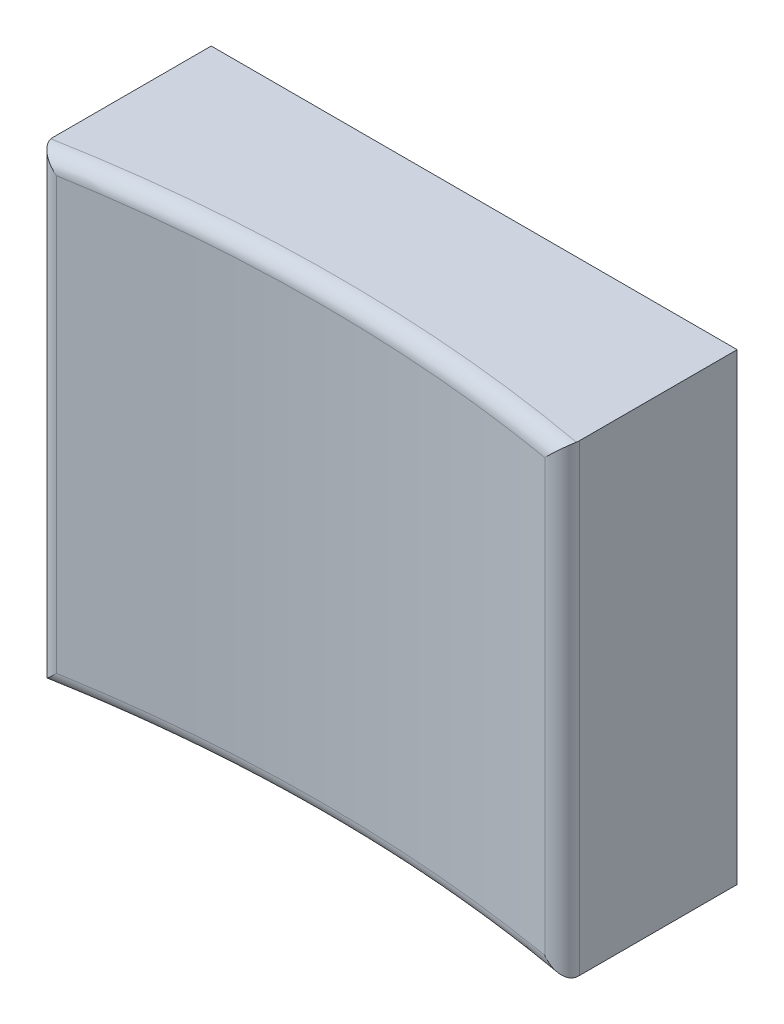
ISO-10303-21;
HEADER;
FILE_DESCRIPTION(('STEP AP214'),'2;1');
FILE_NAME('part.step','',(''),(''),'','','');
FILE_SCHEMA(('AUTOMOTIVE_DESIGN { 1 0 10303 214 1 1 1 1 }'));
ENDSEC;
DATA;
#1=APPLICATION_CONTEXT('core data for automotive mechanical design processes');
#2=APPLICATION_PROTOCOL_DEFINITION('international standard','automotive_design',2000,#1);
#3=PRODUCT_CONTEXT('',#1,'mechanical');
#4=PRODUCT('Part','Part','',(#3));
#5=PRODUCT_RELATED_PRODUCT_CATEGORY('part','',(#4));
#6=PRODUCT_DEFINITION_FORMATION('','',#4);
#7=PRODUCT_DEFINITION_CONTEXT('part definition',#1,'design');
#8=PRODUCT_DEFINITION('design','',#6,#7);
#9=PRODUCT_DEFINITION_SHAPE('','',#8);
#10=(LENGTH_UNIT() NAMED_UNIT(*) SI_UNIT(.MILLI.,.METRE.));
#11=(NAMED_UNIT(*) PLANE_ANGLE_UNIT() SI_UNIT($,.RADIAN.));
#12=(NAMED_UNIT(*) SI_UNIT($,.STERADIAN.) SOLID_ANGLE_UNIT());
#13=UNCERTAINTY_MEASURE_WITH_UNIT(LENGTH_MEASURE(1.E-05),#10,'distance_accuracy_value','');
#14=(GEOMETRIC_REPRESENTATION_CONTEXT(3) GLOBAL_UNCERTAINTY_ASSIGNED_CONTEXT((#13)) GLOBAL_UNIT_ASSIGNED_CONTEXT((#10,
#11,#12)) REPRESENTATION_CONTEXT('',''));
#15=CARTESIAN_POINT('',(0.,0.,0.));
#16=DIRECTION('',(0.,0.,1.));
#17=DIRECTION('',(1.,0.,0.));
#18=AXIS2_PLACEMENT_3D('',#15,#16,#17);
#19=CARTESIAN_POINT('',(-4.1529,3.6576,2.794));
#20=DIRECTION('',(1.,0.,0.));
#21=DIRECTION('',(0.,0.,-1.));
#22=AXIS2_PLACEMENT_3D('',#19,#20,#21);
#23=PLANE('',#22);
#24=DIRECTION('',(0.,0.,-1.));
#25=VECTOR('',#24,1.);
#26=CARTESIAN_POINT('',(-4.1529,-3.6576,2.794));
#27=LINE('',#26,#25);
#28=CARTESIAN_POINT('',(-4.1529,-3.6576,2.49082226780297));
#29=VERTEX_POINT('',#28);
#30=CARTESIAN_POINT('',(-4.1529,-3.6576,0.));
#31=VERTEX_POINT('',#30);
#32=EDGE_CURVE('E102',#29,#31,#27,.T.);
#33=ORIENTED_EDGE('',*,*,#32,.F.);
#34=DIRECTION('',(0.,-1.,0.));
#35=VECTOR('',#34,1.);
#36=CARTESIAN_POINT('',(-4.1529,3.6576,2.49082226780297));
#37=LINE('',#36,#35);
#38=CARTESIAN_POINT('',(-4.1529,3.6576,2.49082226780297));
#39=VERTEX_POINT('',#38);
#40=EDGE_CURVE('E11',#29,#39,#37,.F.);
#41=ORIENTED_EDGE('',*,*,#40,.T.);
#42=DIRECTION('',(0.,0.,-1.));
#43=VECTOR('',#42,1.);
#44=CARTESIAN_POINT('',(-4.1529,3.6576,2.794));
#45=LINE('',#44,#43);
#46=CARTESIAN_POINT('',(-4.1529,3.6576,0.));
#47=VERTEX_POINT('',#46);
#48=EDGE_CURVE('E125',#39,#47,#45,.T.);
#49=ORIENTED_EDGE('',*,*,#48,.T.);
#50=DIRECTION('',(0.,-1.,0.));
#51=VECTOR('',#50,1.);
#52=CARTESIAN_POINT('',(-4.1529,3.6576,0.));
#53=LINE('',#52,#51);
#54=EDGE_CURVE('E121',#47,#31,#53,.T.);
#55=ORIENTED_EDGE('',*,*,#54,.T.);
#56=EDGE_LOOP('',(#33,#41,#49,#55));
#57=FACE_BOUND('',#56,.T.);
#58=ADVANCED_FACE('F32',(#57),#23,.F.);
#59=CARTESIAN_POINT('',(-4.1529,-3.6576,2.794));
#60=DIRECTION('',(0.,1.,0.));
#61=DIRECTION('',(0.,0.,1.));
#62=AXIS2_PLACEMENT_3D('',#59,#60,#61);
#63=PLANE('',#62);
#64=DIRECTION('',(0.,0.,-1.));
#65=VECTOR('',#64,1.);
#66=CARTESIAN_POINT('',(4.1529,-3.6576,2.794));
#67=LINE('',#66,#65);
#68=CARTESIAN_POINT('',(4.1529,-3.6576,2.49082226780297));
#69=VERTEX_POINT('',#68);
#70=CARTESIAN_POINT('',(4.1529,-3.6576,0.));
#71=VERTEX_POINT('',#70);
#72=EDGE_CURVE('E115',#69,#71,#67,.T.);
#73=ORIENTED_EDGE('',*,*,#72,.F.);
#74=CARTESIAN_POINT('',(3.8989,-3.6576,2.49082226780297));
#75=DIRECTION('',(0.,1.,0.));
#76=DIRECTION('',(0.,0.,1.));
#77=AXIS2_PLACEMENT_3D('',#74,#75,#76);
#78=CIRCLE('',#77,0.254);
#79=CARTESIAN_POINT('',(4.14902115128335,-3.6576,2.53504228228519));
#80=VERTEX_POINT('',#79);
#81=EDGE_CURVE('E149',#69,#80,#78,.F.);
#82=ORIENTED_EDGE('',*,*,#81,.T.);
#83=CARTESIAN_POINT('',(0.,-3.6576,25.2736134662053));
#84=DIRECTION('',(0.,1.,0.));
#85=DIRECTION('',(0.,0.,1.));
#86=AXIS2_PLACEMENT_3D('',#83,#84,#85);
#87=CIRCLE('',#86,23.114);
#88=CARTESIAN_POINT('',(-4.14902115128334,-3.6576,2.53504228228519));
#89=VERTEX_POINT('',#88);
#90=EDGE_CURVE('E147',#80,#89,#87,.T.);
#91=ORIENTED_EDGE('',*,*,#90,.T.);
#92=CARTESIAN_POINT('',(-3.8989,-3.6576,2.49082226780297));
#93=DIRECTION('',(0.,1.,0.));
#94=DIRECTION('',(0.,0.,1.));
#95=AXIS2_PLACEMENT_3D('',#92,#93,#94);
#96=CIRCLE('',#95,0.254);
#97=EDGE_CURVE('E110',#89,#29,#96,.F.);
#98=ORIENTED_EDGE('',*,*,#97,.T.);
#99=ORIENTED_EDGE('',*,*,#32,.T.);
#100=DIRECTION('',(1.,0.,0.));
#101=VECTOR('',#100,1.);
#102=CARTESIAN_POINT('',(-4.1529,-3.6576,0.));
#103=LINE('',#102,#101);
#104=EDGE_CURVE('E106',#31,#71,#103,.T.);
#105=ORIENTED_EDGE('',*,*,#104,.T.);
#106=EDGE_LOOP('',(#73,#82,#91,#98,#99,#105));
#107=FACE_BOUND('',#106,.T.);
#108=ADVANCED_FACE('F105',(#107),#63,.F.);
#109=CARTESIAN_POINT('',(4.1529,3.6576,2.794));
#110=DIRECTION('',(-1.,0.,0.));
#111=DIRECTION('',(0.,0.,1.));
#112=AXIS2_PLACEMENT_3D('',#109,#110,#111);
#113=PLANE('',#112);
#114=DIRECTION('',(0.,0.,-1.));
#115=VECTOR('',#114,1.);
#116=CARTESIAN_POINT('',(4.1529,3.6576,2.794));
#117=LINE('',#116,#115);
#118=CARTESIAN_POINT('',(4.1529,3.6576,2.49082226780297));
#119=VERTEX_POINT('',#118);
#120=CARTESIAN_POINT('',(4.1529,3.6576,0.));
#121=VERTEX_POINT('',#120);
#122=EDGE_CURVE('E135',#119,#121,#117,.T.);
#123=ORIENTED_EDGE('',*,*,#122,.F.);
#124=DIRECTION('',(0.,-1.,0.));
#125=VECTOR('',#124,1.);
#126=CARTESIAN_POINT('',(4.1529,3.6576,2.49082226780297));
#127=LINE('',#126,#125);
#128=EDGE_CURVE('E46',#119,#69,#127,.T.);
#129=ORIENTED_EDGE('',*,*,#128,.T.);
#130=ORIENTED_EDGE('',*,*,#72,.T.);
#131=DIRECTION('',(0.,1.,0.));
#132=VECTOR('',#131,1.);
#133=CARTESIAN_POINT('',(4.1529,3.6576,0.));
#134=LINE('',#133,#132);
#135=EDGE_CURVE('E123',#71,#121,#134,.T.);
#136=ORIENTED_EDGE('',*,*,#135,.T.);
#137=EDGE_LOOP('',(#123,#129,#130,#136));
#138=FACE_BOUND('',#137,.T.);
#139=ADVANCED_FACE('F203',(#138),#113,.F.);
#140=CARTESIAN_POINT('',(-4.1529,3.6576,2.794));
#141=DIRECTION('',(0.,-1.,0.));
#142=DIRECTION('',(0.,0.,-1.));
#143=AXIS2_PLACEMENT_3D('',#140,#141,#142);
#144=PLANE('',#143);
#145=CARTESIAN_POINT('',(0.,3.6576,25.2736134662053));
#146=DIRECTION('',(0.,-1.,0.));
#147=DIRECTION('',(0.,0.,-1.));
#148=AXIS2_PLACEMENT_3D('',#145,#146,#147);
#149=CIRCLE('',#148,23.114);
#150=CARTESIAN_POINT('',(-4.14902115128334,3.6576,2.53504228228519));
#151=VERTEX_POINT('',#150);
#152=CARTESIAN_POINT('',(4.14902115128335,3.6576,2.53504228228519));
#153=VERTEX_POINT('',#152);
#154=EDGE_CURVE('E54',#151,#153,#149,.T.);
#155=ORIENTED_EDGE('',*,*,#154,.T.);
#156=CARTESIAN_POINT('',(3.8989,3.6576,2.49082226780297));
#157=DIRECTION('',(0.,-1.,0.));
#158=DIRECTION('',(0.,0.,-1.));
#159=AXIS2_PLACEMENT_3D('',#156,#157,#158);
#160=CIRCLE('',#159,0.254);
#161=EDGE_CURVE('E153',#153,#119,#160,.F.);
#162=ORIENTED_EDGE('',*,*,#161,.T.);
#163=ORIENTED_EDGE('',*,*,#122,.T.);
#164=DIRECTION('',(-1.,0.,0.));
#165=VECTOR('',#164,1.);
#166=CARTESIAN_POINT('',(-4.1529,3.6576,0.));
#167=LINE('',#166,#165);
#168=EDGE_CURVE('E132',#121,#47,#167,.T.);
#169=ORIENTED_EDGE('',*,*,#168,.T.);
#170=ORIENTED_EDGE('',*,*,#48,.F.);
#171=CARTESIAN_POINT('',(-3.8989,3.6576,2.49082226780297));
#172=DIRECTION('',(0.,-1.,0.));
#173=DIRECTION('',(0.,0.,-1.));
#174=AXIS2_PLACEMENT_3D('',#171,#172,#173);
#175=CIRCLE('',#174,0.254);
#176=EDGE_CURVE('E59',#39,#151,#175,.F.);
#177=ORIENTED_EDGE('',*,*,#176,.T.);
#178=EDGE_LOOP('',(#155,#162,#163,#169,#170,#177));
#179=FACE_BOUND('',#178,.T.);
#180=ADVANCED_FACE('F201',(#179),#144,.F.);
#181=CARTESIAN_POINT('',(-4.1529,-3.6576,0.));
#182=DIRECTION('',(0.,0.,1.));
#183=DIRECTION('',(1.,0.,0.));
#184=AXIS2_PLACEMENT_3D('',#181,#182,#183);
#185=PLANE('',#184);
#186=ORIENTED_EDGE('',*,*,#54,.F.);
#187=ORIENTED_EDGE('',*,*,#168,.F.);
#188=ORIENTED_EDGE('',*,*,#135,.F.);
#189=ORIENTED_EDGE('',*,*,#104,.F.);
#190=EDGE_LOOP('',(#186,#187,#188,#189));
#191=FACE_BOUND('',#190,.T.);
#192=ADVANCED_FACE('F119',(#191),#185,.F.);
#193=CARTESIAN_POINT('',(0.,3.6576,25.2736134662053));
#194=DIRECTION('',(0.,-1.,0.));
#195=DIRECTION('',(0.,0.,-1.));
#196=AXIS2_PLACEMENT_3D('',#193,#194,#195);
#197=CYLINDRICAL_SURFACE('',#196,22.86);
#198=DIRECTION('',(0.,-1.,0.));
#199=VECTOR('',#198,1.);
#200=CARTESIAN_POINT('',(-3.85605494505495,3.6576,2.74118261064256));
#201=LINE('',#200,#199);
#202=CARTESIAN_POINT('',(-3.85605494505494,3.4036,2.74118261064256));
#203=VERTEX_POINT('',#202);
#204=CARTESIAN_POINT('',(-3.85605494505494,-3.4036,2.74118261064256));
#205=VERTEX_POINT('',#204);
#206=EDGE_CURVE('E114',#203,#205,#201,.T.);
#207=ORIENTED_EDGE('',*,*,#206,.T.);
#208=CARTESIAN_POINT('',(0.,-3.4036,25.2736134662053));
#209=DIRECTION('',(0.,1.,0.));
#210=DIRECTION('',(0.,0.,1.));
#211=AXIS2_PLACEMENT_3D('',#208,#209,#210);
#212=CIRCLE('',#211,22.86);
#213=CARTESIAN_POINT('',(3.85605494505495,-3.4036,2.74118261064256));
#214=VERTEX_POINT('',#213);
#215=EDGE_CURVE('E143',#205,#214,#212,.F.);
#216=ORIENTED_EDGE('',*,*,#215,.T.);
#217=DIRECTION('',(0.,-1.,0.));
#218=VECTOR('',#217,1.);
#219=CARTESIAN_POINT('',(3.85605494505495,3.6576,2.74118261064256));
#220=LINE('',#219,#218);
#221=CARTESIAN_POINT('',(3.85605494505494,3.4036,2.74118261064256));
#222=VERTEX_POINT('',#221);
#223=EDGE_CURVE('E141',#214,#222,#220,.F.);
#224=ORIENTED_EDGE('',*,*,#223,.T.);
#225=CARTESIAN_POINT('',(0.,3.4036,25.2736134662053));
#226=DIRECTION('',(0.,-1.,0.));
#227=DIRECTION('',(0.,0.,-1.));
#228=AXIS2_PLACEMENT_3D('',#225,#226,#227);
#229=CIRCLE('',#228,22.86);
#230=EDGE_CURVE('E139',#222,#203,#229,.F.);
#231=ORIENTED_EDGE('',*,*,#230,.T.);
#232=EDGE_LOOP('',(#207,#216,#224,#231));
#233=FACE_BOUND('',#232,.T.);
#234=ADVANCED_FACE('F197',(#233),#197,.F.);
#235=CARTESIAN_POINT('',(0.,3.4036,25.2736134662053));
#236=DIRECTION('',(0.,-1.,0.));
#237=DIRECTION('',(0.,0.,-1.));
#238=AXIS2_PLACEMENT_3D('',#235,#236,#237);
#239=TOROIDAL_SURFACE('',#238,23.114,0.254);
#240=CARTESIAN_POINT('',(4.14902115128334,3.6576,2.53504228228519));
#241=CARTESIAN_POINT('',(4.147057413291,3.65761941798704,2.54626051410528));
#242=CARTESIAN_POINT('',(4.14430772511394,3.6568354333532,2.55731081895926));
#243=CARTESIAN_POINT('',(4.13747618648574,3.65382566993983,2.57868277036022));
#244=CARTESIAN_POINT('',(4.13340609550221,3.65161245353686,2.58900990487564));
#245=CARTESIAN_POINT('',(4.12414457602549,3.64591191486797,2.60872099226871));
#246=CARTESIAN_POINT('',(4.11895619634246,3.64242803929229,2.61810740987538));
#247=CARTESIAN_POINT('',(4.10768989632173,3.63439821947881,2.63585133698443));
#248=CARTESIAN_POINT('',(4.10160999846191,3.6298499004188,2.64420648105353));
#249=CARTESIAN_POINT('',(4.08616781818806,3.61787034509634,2.66301192454394));
#250=CARTESIAN_POINT('',(4.07647841036786,3.61002001166474,2.67292620715351));
#251=CARTESIAN_POINT('',(4.05626652321987,3.59311999450385,2.69065535724881));
#252=CARTESIAN_POINT('',(4.04574245787371,3.58406800428347,2.69846609755017));
#253=CARTESIAN_POINT('',(4.01998736240649,3.56142212858062,2.71480621902723));
#254=CARTESIAN_POINT('',(4.00452436143891,3.5474358957305,2.72242320526477));
#255=CARTESIAN_POINT('',(3.9732291866513,3.51849989343228,2.73427998095239));
#256=CARTESIAN_POINT('',(3.95739661035331,3.50354903893871,2.73851589304369));
#257=CARTESIAN_POINT('',(3.92754170272988,3.4748495058296,2.74360271280981));
#258=CARTESIAN_POINT('',(3.91351825281961,3.46115745374889,2.74478377230257));
#259=CARTESIAN_POINT('',(3.88568860791458,3.43359421272603,2.7448588164792));
#260=CARTESIAN_POINT('',(3.87188203426182,3.41972343717708,2.74375737401577));
#261=CARTESIAN_POINT('',(3.85753243966568,3.40510670739394,2.74143209205596));
#262=CARTESIAN_POINT('',(3.8567933938316,3.40435333384913,2.74130897875889));
#263=CARTESIAN_POINT('',(3.85605494505495,3.4036,2.74118261064256));
#264=B_SPLINE_CURVE_WITH_KNOTS('',3,(#240,#241,#242,#243,#244,#245,#246,#247,#248,#249,#250,
#251,#252,#253,#254,#255,#256,#257,#258,#259,#260,#261,#262,#263),.UNSPECIFIED.,.F.,.F.,(4,2,2,
2,2,2,2,2,2,2,2,4),(0.,0.0340672177638823,0.0678390004190167,0.101519849519903,
0.135276570813308,0.182806102249537,0.230428219033018,0.296664129326276,0.362975889149356,
0.421746978486034,0.480400437389645,0.483587928393868),.UNSPECIFIED.);
#265=EDGE_CURVE('E129',#153,#222,#264,.T.);
#266=ORIENTED_EDGE('',*,*,#265,.F.);
#267=ORIENTED_EDGE('',*,*,#154,.F.);
#268=CARTESIAN_POINT('',(-4.14902115128334,3.6576,2.53504228228519));
#269=CARTESIAN_POINT('',(-4.147057413291,3.65761941798704,2.54626051410528));
#270=CARTESIAN_POINT('',(-4.14430772511394,3.6568354333532,2.55731081895926));
#271=CARTESIAN_POINT('',(-4.13747618648574,3.65382566993983,2.57868277036022));
#272=CARTESIAN_POINT('',(-4.13340609550221,3.65161245353686,2.58900990487564));
#273=CARTESIAN_POINT('',(-4.12414457602549,3.64591191486797,2.60872099226871));
#274=CARTESIAN_POINT('',(-4.11895619634246,3.64242803929229,2.61810740987538));
#275=CARTESIAN_POINT('',(-4.10768989632173,3.63439821947881,2.63585133698443));
#276=CARTESIAN_POINT('',(-4.10160999846191,3.6298499004188,2.64420648105353));
#277=CARTESIAN_POINT('',(-4.08616781818806,3.61787034509634,2.66301192454394));
#278=CARTESIAN_POINT('',(-4.07647841036786,3.61002001166474,2.67292620715351));
#279=CARTESIAN_POINT('',(-4.05626652321987,3.59311999450385,2.69065535724881));
#280=CARTESIAN_POINT('',(-4.04574245787371,3.58406800428347,2.69846609755017));
#281=CARTESIAN_POINT('',(-4.01998736240649,3.56142212858062,2.71480621902723));
#282=CARTESIAN_POINT('',(-4.00452436143891,3.5474358957305,2.72242320526477));
#283=CARTESIAN_POINT('',(-3.9732291866513,3.51849989343228,2.73427998095239));
#284=CARTESIAN_POINT('',(-3.95739661035331,3.50354903893871,2.73851589304369));
#285=CARTESIAN_POINT('',(-3.92754170272988,3.4748495058296,2.74360271280981));
#286=CARTESIAN_POINT('',(-3.91351825281961,3.46115745374889,2.74478377230257));
#287=CARTESIAN_POINT('',(-3.88568860791458,3.43359421272603,2.7448588164792));
#288=CARTESIAN_POINT('',(-3.87188203426182,3.41972343717708,2.74375737401577));
#289=CARTESIAN_POINT('',(-3.85753243966568,3.40510670739394,2.74143209205596));
#290=CARTESIAN_POINT('',(-3.8567933938316,3.40435333384913,2.74130897875889));
#291=CARTESIAN_POINT('',(-3.85605494505495,3.4036,2.74118261064256));
#292=B_SPLINE_CURVE_WITH_KNOTS('',3,(#268,#269,#270,#271,#272,#273,#274,#275,#276,#277,#278,
#279,#280,#281,#282,#283,#284,#285,#286,#287,#288,#289,#290,#291),.UNSPECIFIED.,.F.,.F.,(4,2,2,
2,2,2,2,2,2,2,2,4),(0.,0.0340672177638823,0.0678390004190167,0.101519849519903,
0.135276570813308,0.182806102249537,0.230428219033018,0.296664129326276,0.362975889149356,
0.421746978486034,0.480400437389645,0.483587928393868),.UNSPECIFIED.);
#293=EDGE_CURVE('E37',#203,#151,#292,.F.);
#294=ORIENTED_EDGE('',*,*,#293,.F.);
#295=ORIENTED_EDGE('',*,*,#230,.F.);
#296=EDGE_LOOP('',(#266,#267,#294,#295));
#297=FACE_BOUND('',#296,.T.);
#298=ADVANCED_FACE('F34',(#297),#239,.T.);
#299=CARTESIAN_POINT('',(-3.8989,3.6576,2.49082226780297));
#300=DIRECTION('',(0.,-1.,0.));
#301=DIRECTION('',(0.,0.,-1.));
#302=AXIS2_PLACEMENT_3D('',#299,#300,#301);
#303=CYLINDRICAL_SURFACE('',#302,0.254);
#304=ORIENTED_EDGE('',*,*,#40,.F.);
#305=ORIENTED_EDGE('',*,*,#97,.F.);
#306=CARTESIAN_POINT('',(-4.14902115128334,-3.6576,2.53504228228519));
#307=CARTESIAN_POINT('',(-4.147057413291,-3.65761941798704,2.54626051410528));
#308=CARTESIAN_POINT('',(-4.14430772511394,-3.6568354333532,2.55731081895926));
#309=CARTESIAN_POINT('',(-4.13747618648574,-3.65382566993983,2.57868277036022));
#310=CARTESIAN_POINT('',(-4.13340609550221,-3.65161245353686,2.58900990487564));
#311=CARTESIAN_POINT('',(-4.12414457602549,-3.64591191486797,2.60872099226871));
#312=CARTESIAN_POINT('',(-4.11895619634246,-3.64242803929229,2.61810740987538));
#313=CARTESIAN_POINT('',(-4.10768989632173,-3.63439821947881,2.63585133698443));
#314=CARTESIAN_POINT('',(-4.10160999846191,-3.6298499004188,2.64420648105353));
#315=CARTESIAN_POINT('',(-4.08616781818806,-3.61787034509634,2.66301192454394));
#316=CARTESIAN_POINT('',(-4.07647841036786,-3.61002001166474,2.67292620715351));
#317=CARTESIAN_POINT('',(-4.05626652321987,-3.59311999450385,2.69065535724881));
#318=CARTESIAN_POINT('',(-4.04574245787371,-3.58406800428347,2.69846609755017));
#319=CARTESIAN_POINT('',(-4.01998736240649,-3.56142212858062,2.71480621902723));
#320=CARTESIAN_POINT('',(-4.00452436143891,-3.5474358957305,2.72242320526477));
#321=CARTESIAN_POINT('',(-3.9732291866513,-3.51849989343228,2.73427998095239));
#322=CARTESIAN_POINT('',(-3.95739661035331,-3.50354903893871,2.73851589304369));
#323=CARTESIAN_POINT('',(-3.92754170272988,-3.4748495058296,2.74360271280981));
#324=CARTESIAN_POINT('',(-3.91351825281961,-3.46115745374889,2.74478377230257));
#325=CARTESIAN_POINT('',(-3.88568860791458,-3.43359421272603,2.7448588164792));
#326=CARTESIAN_POINT('',(-3.87188203426182,-3.41972343717708,2.74375737401577));
#327=CARTESIAN_POINT('',(-3.85753243966568,-3.40510670739394,2.74143209205596));
#328=CARTESIAN_POINT('',(-3.8567933938316,-3.40435333384913,2.74130897875889));
#329=CARTESIAN_POINT('',(-3.85605494505495,-3.4036,2.74118261064256));
#330=B_SPLINE_CURVE_WITH_KNOTS('',3,(#306,#307,#308,#309,#310,#311,#312,#313,#314,#315,#316,
#317,#318,#319,#320,#321,#322,#323,#324,#325,#326,#327,#328,#329),.UNSPECIFIED.,.F.,.F.,(4,2,2,
2,2,2,2,2,2,2,2,4),(0.,0.0340672177638823,0.0678390004190167,0.101519849519903,
0.135276570813308,0.182806102249537,0.230428219033018,0.296664129326276,0.362975889149356,
0.421746978486034,0.480400437389645,0.483587928393868),.UNSPECIFIED.);
#331=EDGE_CURVE('E164',#205,#89,#330,.F.);
#332=ORIENTED_EDGE('',*,*,#331,.F.);
#333=ORIENTED_EDGE('',*,*,#206,.F.);
#334=ORIENTED_EDGE('',*,*,#293,.T.);
#335=ORIENTED_EDGE('',*,*,#176,.F.);
#336=EDGE_LOOP('',(#304,#305,#332,#333,#334,#335));
#337=FACE_BOUND('',#336,.T.);
#338=ADVANCED_FACE('F175',(#337),#303,.T.);
#339=CARTESIAN_POINT('',(3.8989,3.6576,2.49082226780297));
#340=DIRECTION('',(0.,-1.,0.));
#341=DIRECTION('',(0.,0.,-1.));
#342=AXIS2_PLACEMENT_3D('',#339,#340,#341);
#343=CYLINDRICAL_SURFACE('',#342,0.254);
#344=ORIENTED_EDGE('',*,*,#265,.T.);
#345=ORIENTED_EDGE('',*,*,#223,.F.);
#346=CARTESIAN_POINT('',(4.14902115128334,-3.6576,2.53504228228519));
#347=CARTESIAN_POINT('',(4.147057413291,-3.65761941798704,2.54626051410528));
#348=CARTESIAN_POINT('',(4.14430772511394,-3.6568354333532,2.55731081895926));
#349=CARTESIAN_POINT('',(4.13747618648574,-3.65382566993983,2.57868277036022));
#350=CARTESIAN_POINT('',(4.13340609550221,-3.65161245353686,2.58900990487564));
#351=CARTESIAN_POINT('',(4.12414457602549,-3.64591191486797,2.60872099226871));
#352=CARTESIAN_POINT('',(4.11895619634246,-3.64242803929229,2.61810740987538));
#353=CARTESIAN_POINT('',(4.10768989632173,-3.63439821947881,2.63585133698443));
#354=CARTESIAN_POINT('',(4.10160999846191,-3.6298499004188,2.64420648105353));
#355=CARTESIAN_POINT('',(4.08616781818806,-3.61787034509634,2.66301192454394));
#356=CARTESIAN_POINT('',(4.07647841036786,-3.61002001166474,2.67292620715351));
#357=CARTESIAN_POINT('',(4.05626652321987,-3.59311999450385,2.69065535724881));
#358=CARTESIAN_POINT('',(4.04574245787371,-3.58406800428347,2.69846609755017));
#359=CARTESIAN_POINT('',(4.01998736240649,-3.56142212858062,2.71480621902723));
#360=CARTESIAN_POINT('',(4.00452436143892,-3.54743589573049,2.72242320526477));
#361=CARTESIAN_POINT('',(3.9732291866513,-3.51849989343228,2.73427998095239));
#362=CARTESIAN_POINT('',(3.9573966103533,-3.50354903893872,2.73851589304369));
#363=CARTESIAN_POINT('',(3.92754170272989,-3.47484950582959,2.74360271280981));
#364=CARTESIAN_POINT('',(3.91351825281964,-3.46115745374887,2.74478377230257));
#365=CARTESIAN_POINT('',(3.88568860791457,-3.43359421272604,2.7448588164792));
#366=CARTESIAN_POINT('',(3.87188203426175,-3.41972343717715,2.74375737401576));
#367=CARTESIAN_POINT('',(3.85753243966567,-3.40510670739395,2.74143209205596));
#368=CARTESIAN_POINT('',(3.85679339383159,-3.40435333384913,2.74130897875889));
#369=CARTESIAN_POINT('',(3.85605494505495,-3.4036,2.74118261064256));
#370=B_SPLINE_CURVE_WITH_KNOTS('',3,(#346,#347,#348,#349,#350,#351,#352,#353,#354,#355,#356,
#357,#358,#359,#360,#361,#362,#363,#364,#365,#366,#367,#368,#369),.UNSPECIFIED.,.F.,.F.,(4,2,2,
2,2,2,2,2,2,2,2,4),(0.,0.0340672177638827,0.0678390004190167,0.101519849519903,
0.135276570813308,0.182806102249536,0.230428219033018,0.296664129326277,0.362975889149356,
0.421746978486034,0.480400437389645,0.483587928393868),.UNSPECIFIED.);
#371=EDGE_CURVE('E156',#80,#214,#370,.T.);
#372=ORIENTED_EDGE('',*,*,#371,.F.);
#373=ORIENTED_EDGE('',*,*,#81,.F.);
#374=ORIENTED_EDGE('',*,*,#128,.F.);
#375=ORIENTED_EDGE('',*,*,#161,.F.);
#376=EDGE_LOOP('',(#344,#345,#372,#373,#374,#375));
#377=FACE_BOUND('',#376,.T.);
#378=ADVANCED_FACE('F172',(#377),#343,.T.);
#379=CARTESIAN_POINT('',(0.,-3.4036,25.2736134662053));
#380=DIRECTION('',(0.,1.,0.));
#381=DIRECTION('',(0.,0.,1.));
#382=AXIS2_PLACEMENT_3D('',#379,#380,#381);
#383=TOROIDAL_SURFACE('',#382,23.114,0.254);
#384=ORIENTED_EDGE('',*,*,#331,.T.);
#385=ORIENTED_EDGE('',*,*,#90,.F.);
#386=ORIENTED_EDGE('',*,*,#371,.T.);
#387=ORIENTED_EDGE('',*,*,#215,.F.);
#388=EDGE_LOOP('',(#384,#385,#386,#387));
#389=FACE_BOUND('',#388,.T.);
#390=ADVANCED_FACE('F169',(#389),#383,.T.);
#391=CLOSED_SHELL('',(#58,#108,#139,#180,#192,#234,#298,#338,#378,#390));
#392=MANIFOLD_SOLID_BREP('B2',#391);
#393=ADVANCED_BREP_SHAPE_REPRESENTATION('',(#18,#392),#14);
#394=SHAPE_DEFINITION_REPRESENTATION(#9,#393);
ENDSEC;
END-ISO-10303-21;
